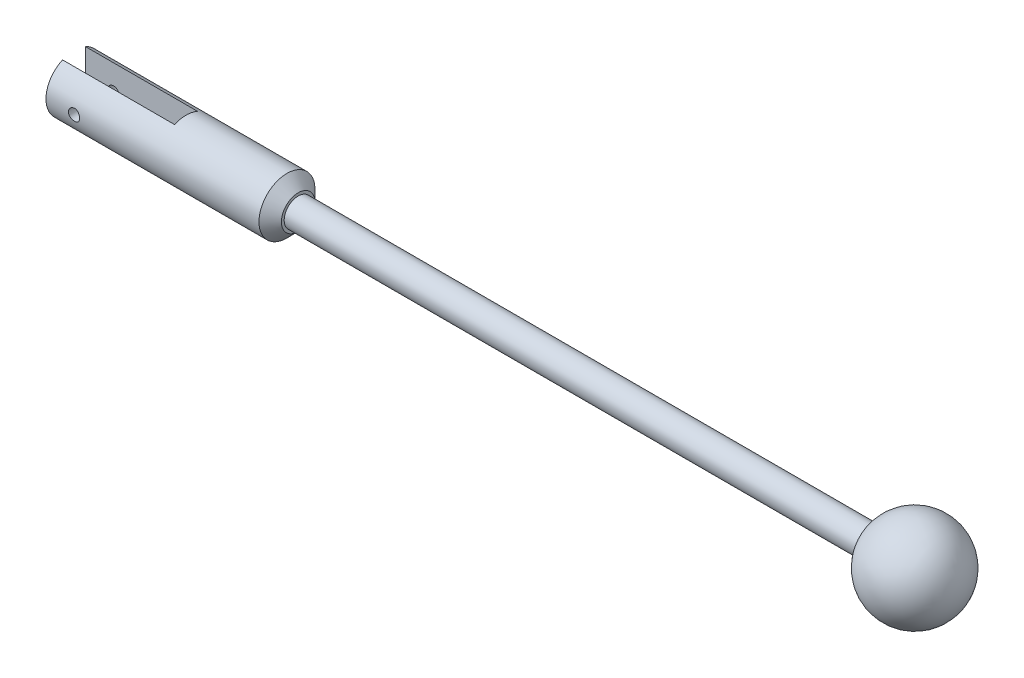
ISO-10303-21;
HEADER;
FILE_DESCRIPTION(('STEP AP214'),'2;1');
FILE_NAME('part.step','',(''),(''),'','','');
FILE_SCHEMA(('AUTOMOTIVE_DESIGN { 1 0 10303 214 1 1 1 1 }'));
ENDSEC;
DATA;
#1=APPLICATION_CONTEXT('core data for automotive mechanical design processes');
#2=APPLICATION_PROTOCOL_DEFINITION('international standard','automotive_design',2000,#1);
#3=PRODUCT_CONTEXT('',#1,'mechanical');
#4=PRODUCT('Part','Part','',(#3));
#5=PRODUCT_RELATED_PRODUCT_CATEGORY('part','',(#4));
#6=PRODUCT_DEFINITION_FORMATION('','',#4);
#7=PRODUCT_DEFINITION_CONTEXT('part definition',#1,'design');
#8=PRODUCT_DEFINITION('design','',#6,#7);
#9=PRODUCT_DEFINITION_SHAPE('','',#8);
#10=(LENGTH_UNIT() NAMED_UNIT(*) SI_UNIT(.MILLI.,.METRE.));
#11=(NAMED_UNIT(*) PLANE_ANGLE_UNIT() SI_UNIT($,.RADIAN.));
#12=(NAMED_UNIT(*) SI_UNIT($,.STERADIAN.) SOLID_ANGLE_UNIT());
#13=UNCERTAINTY_MEASURE_WITH_UNIT(LENGTH_MEASURE(1.E-05),#10,'distance_accuracy_value','');
#14=(GEOMETRIC_REPRESENTATION_CONTEXT(3) GLOBAL_UNCERTAINTY_ASSIGNED_CONTEXT((#13)) GLOBAL_UNIT_ASSIGNED_CONTEXT((#10,
#11,#12)) REPRESENTATION_CONTEXT('',''));
#15=CARTESIAN_POINT('',(0.,0.,0.));
#16=DIRECTION('',(0.,0.,1.));
#17=DIRECTION('',(1.,0.,0.));
#18=AXIS2_PLACEMENT_3D('',#15,#16,#17);
#19=CARTESIAN_POINT('',(-17.5,0.,0.));
#20=DIRECTION('',(-1.,0.,0.));
#21=DIRECTION('',(0.,0.,1.));
#22=AXIS2_PLACEMENT_3D('',#19,#20,#21);
#23=CYLINDRICAL_SURFACE('',#22,2.5);
#24=CARTESIAN_POINT('',(-34.5,0.,-2.5));
#25=CARTESIAN_POINT('',(-34.5000010222492,-0.0277884533963162,-2.49999948790436));
#26=CARTESIAN_POINT('',(-34.5023244214838,-0.0555898301007603,-2.49953192589115));
#27=CARTESIAN_POINT('',(-34.5115492500576,-0.110406753844509,-2.49771182811616));
#28=CARTESIAN_POINT('',(-34.5184543164007,-0.137421658770677,-2.49635858930093));
#29=CARTESIAN_POINT('',(-34.5366206368104,-0.189865152631657,-2.49291824639143));
#30=CARTESIAN_POINT('',(-34.5478777184223,-0.215295233966568,-2.49083184538359));
#31=CARTESIAN_POINT('',(-34.5744161237556,-0.263903994432113,-2.48615199017657));
#32=CARTESIAN_POINT('',(-34.5896972078036,-0.287082807537904,-2.48355856617854));
#33=CARTESIAN_POINT('',(-34.6240692471457,-0.33084673865743,-2.47811082664985));
#34=CARTESIAN_POINT('',(-34.6432041776956,-0.351396975579262,-2.47525372752174));
#35=CARTESIAN_POINT('',(-34.6846462081958,-0.389018378304014,-2.46962090226294));
#36=CARTESIAN_POINT('',(-34.7069535556676,-0.406089272385212,-2.46684518250212));
#37=CARTESIAN_POINT('',(-34.7543580965059,-0.43641587667381,-2.46166220906308));
#38=CARTESIAN_POINT('',(-34.7794788218982,-0.449635469432934,-2.45925853682473));
#39=CARTESIAN_POINT('',(-34.831640909502,-0.471652833290154,-2.45513134029209));
#40=CARTESIAN_POINT('',(-34.8586820816732,-0.480451041218618,-2.45340774880981));
#41=CARTESIAN_POINT('',(-34.913542181954,-0.493262649942413,-2.45086402626102));
#42=CARTESIAN_POINT('',(-34.9413462720711,-0.497337248979388,-2.45003235053594));
#43=CARTESIAN_POINT('',(-34.9972549106822,-0.500776063863058,-2.44933187530314));
#44=CARTESIAN_POINT('',(-35.0253594281601,-0.500140761356749,-2.4494629773392));
#45=CARTESIAN_POINT('',(-35.0806233940105,-0.49422728655091,-2.45066275574092));
#46=CARTESIAN_POINT('',(-35.1077907028136,-0.489019270121953,-2.45171726429382));
#47=CARTESIAN_POINT('',(-35.1608580383315,-0.474218942311526,-2.45462273080001));
#48=CARTESIAN_POINT('',(-35.1867580044595,-0.464626421550342,-2.45647372678889));
#49=CARTESIAN_POINT('',(-35.2367576308518,-0.441262391837361,-2.46077809250204));
#50=CARTESIAN_POINT('',(-35.2608439397846,-0.427463075616057,-2.46323544906852));
#51=CARTESIAN_POINT('',(-35.3063854249864,-0.396096787286339,-2.46847309386531));
#52=CARTESIAN_POINT('',(-35.3278402984256,-0.378529382178414,-2.47125341919183));
#53=CARTESIAN_POINT('',(-35.3679147012285,-0.33974996728029,-2.47688510620731));
#54=CARTESIAN_POINT('',(-35.3864762839296,-0.31847808060622,-2.47973684605452));
#55=CARTESIAN_POINT('',(-35.4197769231506,-0.273092512031003,-2.48514424357204));
#56=CARTESIAN_POINT('',(-35.4345159306468,-0.248978793689694,-2.48769989744487));
#57=CARTESIAN_POINT('',(-35.459763754613,-0.198529693439462,-2.49223345080444));
#58=CARTESIAN_POINT('',(-35.4702659468223,-0.172190909792653,-2.49421044424136));
#59=CARTESIAN_POINT('',(-35.4866802370193,-0.118074488224335,-2.49735704493929));
#60=CARTESIAN_POINT('',(-35.4925928910368,-0.0902970250362264,-2.49852675000266));
#61=CARTESIAN_POINT('',(-35.4995782268971,-0.0345897028135759,-2.49991335933434));
#62=CARTESIAN_POINT('',(-35.5007302097701,-0.00667016416278892,-2.50014587326235));
#63=CARTESIAN_POINT('',(-35.4983750705289,0.0489624670963558,-2.49967525965051));
#64=CARTESIAN_POINT('',(-35.4948682103237,0.0766755712218952,-2.49897218470723));
#65=CARTESIAN_POINT('',(-35.483360813228,0.130852829973268,-2.49671916004009));
#66=CARTESIAN_POINT('',(-35.475400965751,0.157325974169949,-2.49517688202103));
#67=CARTESIAN_POINT('',(-35.4552580086721,0.208561813749831,-2.49141776030516));
#68=CARTESIAN_POINT('',(-35.4430745826616,0.233324380818767,-2.48920086607113));
#69=CARTESIAN_POINT('',(-35.4146587546743,0.280770586843106,-2.48429955766647));
#70=CARTESIAN_POINT('',(-35.3983786094805,0.303425063376092,-2.48160975218526));
#71=CARTESIAN_POINT('',(-35.3622954043963,0.345709009559601,-2.47607367414941));
#72=CARTESIAN_POINT('',(-35.3424919668001,0.365338154465377,-2.47322738484194));
#73=CARTESIAN_POINT('',(-35.2995633240544,0.401320295387084,-2.46764651778483));
#74=CARTESIAN_POINT('',(-35.2763921278893,0.417618851224324,-2.46491430116652));
#75=CARTESIAN_POINT('',(-35.2275943193217,0.446092710025601,-2.45992095898097));
#76=CARTESIAN_POINT('',(-35.2019678052132,0.45826817796145,-2.45765981456671));
#77=CARTESIAN_POINT('',(-35.1491158769252,0.478075920790979,-2.45388370292191));
#78=CARTESIAN_POINT('',(-35.1218995793948,0.485731749895525,-2.45236487436093));
#79=CARTESIAN_POINT('',(-35.0665332732545,0.496354325813598,-2.45023718396013));
#80=CARTESIAN_POINT('',(-35.0383833868953,0.499321684112555,-2.44962820345556));
#81=CARTESIAN_POINT('',(-34.9824955677278,0.500460455433733,-2.4493957481569));
#82=CARTESIAN_POINT('',(-34.9547594255365,0.498717894035447,-2.4497545959465));
#83=CARTESIAN_POINT('',(-34.8999841750475,0.49067615205003,-2.45137786742307));
#84=CARTESIAN_POINT('',(-34.8729450611526,0.484377008064648,-2.45264228383585));
#85=CARTESIAN_POINT('',(-34.8203861443797,0.467439284249475,-2.45592632109579));
#86=CARTESIAN_POINT('',(-34.7948628197488,0.45681125335867,-2.45794410509415));
#87=CARTESIAN_POINT('',(-34.7459481396328,0.4315273223008,-2.46250857487085));
#88=CARTESIAN_POINT('',(-34.7225569631374,0.416871084387441,-2.46505530499447));
#89=CARTESIAN_POINT('',(-34.6781422139248,0.383652957393207,-2.47044480261613));
#90=CARTESIAN_POINT('',(-34.6571656173662,0.365028943617589,-2.4732918645485));
#91=CARTESIAN_POINT('',(-34.6186068972354,0.324532184506568,-2.47893040935977));
#92=CARTESIAN_POINT('',(-34.6010255548414,0.302658693576666,-2.48172187931592));
#93=CARTESIAN_POINT('',(-34.5695826780268,0.256008814544122,-2.48696916193986));
#94=CARTESIAN_POINT('',(-34.55576199836,0.231204442214915,-2.48942115609623));
#95=CARTESIAN_POINT('',(-34.5325069387017,0.179583180470364,-2.493675625425));
#96=CARTESIAN_POINT('',(-34.5230686052337,0.152768130431562,-2.49547868569308));
#97=CARTESIAN_POINT('',(-34.5106740259776,0.10491074446189,-2.49788186297685));
#98=CARTESIAN_POINT('',(-34.5066784031461,0.0841408320068929,-2.49867151579226));
#99=CARTESIAN_POINT('',(-34.5013410438208,0.0422497626050339,-2.49973077069946));
#100=CARTESIAN_POINT('',(-34.4999992227451,0.0211286168743097,-2.50000038936577));
#101=CARTESIAN_POINT('',(-34.5,0.,-2.5));
#102=B_SPLINE_CURVE_WITH_KNOTS('',3,(#24,#25,#26,#27,#28,#29,#30,#31,#32,#33,#34,#35,#36,#37,
#38,#39,#40,#41,#42,#43,#44,#45,#46,#47,#48,#49,#50,#51,#52,#53,#54,#55,#56,#57,#58,#59,#60,#61,
#62,#63,#64,#65,#66,#67,#68,#69,#70,#71,#72,#73,#74,#75,#76,#77,#78,#79,#80,#81,#82,#83,#84,#85,
#86,#87,#88,#89,#90,#91,#92,#93,#94,#95,#96,#97,#98,#99,#100,#101),.UNSPECIFIED.,.T.,.F.,(4,2,2,
2,2,2,2,2,2,2,2,2,2,2,2,2,2,2,2,2,2,2,2,2,2,2,2,2,2,2,2,2,2,2,2,2,2,2,4),(0.,0.0832880653306286,
0.16664232534566,0.24991686762517,0.333186451115431,0.417466335056094,0.501752798373683,
0.586805975029615,0.671850746825986,0.755780925517941,0.839702521406118,0.922358635031387,
1.00501869626864,1.08823745101796,1.17146577374835,1.25619126245675,1.3409178376991,
1.42577637427011,1.51062462849017,1.59405367838132,1.67747803828933,1.76015226975361,
1.84283269608011,1.92652533016678,2.01022694172964,2.09520314289612,2.18017594361733,
2.26470190516361,2.34921684165207,2.4321986128385,2.51517971746304,2.59795980626555,
2.68074683790933,2.76494038119571,2.84915327266465,2.93424748337818,3.01926477758759,
3.08259387644946,3.14592095685497),.UNSPECIFIED.);
#103=CARTESIAN_POINT('',(-34.5,0.,-2.5));
#104=VERTEX_POINT('',#103);
#105=EDGE_CURVE('E158',#104,#104,#102,.T.);
#106=ORIENTED_EDGE('',*,*,#105,.F.);
#107=EDGE_LOOP('',(#106));
#108=FACE_BOUND('',#107,.T.);
#109=CARTESIAN_POINT('',(-34.5,0.,2.5));
#110=CARTESIAN_POINT('',(-34.5000010222492,0.0277884533963162,2.49999948790436));
#111=CARTESIAN_POINT('',(-34.5023244214838,0.0555898301007603,2.49953192589115));
#112=CARTESIAN_POINT('',(-34.5115492500576,0.110406753844509,2.49771182811616));
#113=CARTESIAN_POINT('',(-34.5184543164007,0.137421658770677,2.49635858930093));
#114=CARTESIAN_POINT('',(-34.5366206368104,0.189865152631657,2.49291824639143));
#115=CARTESIAN_POINT('',(-34.5478777184223,0.215295233966568,2.49083184538359));
#116=CARTESIAN_POINT('',(-34.5744161237556,0.263903994432113,2.48615199017657));
#117=CARTESIAN_POINT('',(-34.5896972078036,0.287082807537904,2.48355856617854));
#118=CARTESIAN_POINT('',(-34.6240692471457,0.33084673865743,2.47811082664985));
#119=CARTESIAN_POINT('',(-34.6432041776956,0.351396975579262,2.47525372752174));
#120=CARTESIAN_POINT('',(-34.6846462081958,0.389018378304014,2.46962090226294));
#121=CARTESIAN_POINT('',(-34.7069535556676,0.406089272385212,2.46684518250212));
#122=CARTESIAN_POINT('',(-34.7543580965059,0.43641587667381,2.46166220906308));
#123=CARTESIAN_POINT('',(-34.7794788218982,0.449635469432934,2.45925853682473));
#124=CARTESIAN_POINT('',(-34.831640909502,0.471652833290154,2.45513134029209));
#125=CARTESIAN_POINT('',(-34.8586820816732,0.480451041218618,2.45340774880981));
#126=CARTESIAN_POINT('',(-34.913542181954,0.493262649942413,2.45086402626102));
#127=CARTESIAN_POINT('',(-34.9413462720711,0.497337248979388,2.45003235053594));
#128=CARTESIAN_POINT('',(-34.9972549106822,0.500776063863058,2.44933187530314));
#129=CARTESIAN_POINT('',(-35.0253594281601,0.500140761356749,2.4494629773392));
#130=CARTESIAN_POINT('',(-35.0806233940105,0.49422728655091,2.45066275574092));
#131=CARTESIAN_POINT('',(-35.1077907028136,0.489019270121953,2.45171726429382));
#132=CARTESIAN_POINT('',(-35.1608580383315,0.474218942311526,2.45462273080001));
#133=CARTESIAN_POINT('',(-35.1867580044595,0.464626421550342,2.45647372678889));
#134=CARTESIAN_POINT('',(-35.2367576308518,0.441262391837361,2.46077809250204));
#135=CARTESIAN_POINT('',(-35.2608439397846,0.427463075616057,2.46323544906852));
#136=CARTESIAN_POINT('',(-35.3063854249864,0.396096787286339,2.46847309386531));
#137=CARTESIAN_POINT('',(-35.3278402984256,0.378529382178414,2.47125341919183));
#138=CARTESIAN_POINT('',(-35.3679147012285,0.33974996728029,2.47688510620731));
#139=CARTESIAN_POINT('',(-35.3864762839296,0.31847808060622,2.47973684605452));
#140=CARTESIAN_POINT('',(-35.4197769231506,0.273092512031003,2.48514424357204));
#141=CARTESIAN_POINT('',(-35.4345159306468,0.248978793689694,2.48769989744487));
#142=CARTESIAN_POINT('',(-35.459763754613,0.198529693439462,2.49223345080444));
#143=CARTESIAN_POINT('',(-35.4702659468223,0.172190909792653,2.49421044424136));
#144=CARTESIAN_POINT('',(-35.4866802370193,0.118074488224335,2.49735704493929));
#145=CARTESIAN_POINT('',(-35.4925928910368,0.0902970250362264,2.49852675000266));
#146=CARTESIAN_POINT('',(-35.4995782268971,0.0345897028135759,2.49991335933434));
#147=CARTESIAN_POINT('',(-35.5007302097701,0.00667016416278892,2.50014587326235));
#148=CARTESIAN_POINT('',(-35.4983750705289,-0.0489624670963558,2.49967525965051));
#149=CARTESIAN_POINT('',(-35.4948682103237,-0.0766755712218952,2.49897218470723));
#150=CARTESIAN_POINT('',(-35.483360813228,-0.130852829973268,2.49671916004009));
#151=CARTESIAN_POINT('',(-35.475400965751,-0.157325974169949,2.49517688202103));
#152=CARTESIAN_POINT('',(-35.4552580086721,-0.208561813749831,2.49141776030516));
#153=CARTESIAN_POINT('',(-35.4430745826616,-0.233324380818767,2.48920086607113));
#154=CARTESIAN_POINT('',(-35.4146587546743,-0.280770586843106,2.48429955766647));
#155=CARTESIAN_POINT('',(-35.3983786094805,-0.303425063376092,2.48160975218526));
#156=CARTESIAN_POINT('',(-35.3622954043963,-0.345709009559601,2.47607367414941));
#157=CARTESIAN_POINT('',(-35.3424919668001,-0.365338154465377,2.47322738484194));
#158=CARTESIAN_POINT('',(-35.2995633240544,-0.401320295387084,2.46764651778483));
#159=CARTESIAN_POINT('',(-35.2763921278893,-0.417618851224324,2.46491430116652));
#160=CARTESIAN_POINT('',(-35.2275943193217,-0.446092710025601,2.45992095898097));
#161=CARTESIAN_POINT('',(-35.2019678052132,-0.45826817796145,2.45765981456671));
#162=CARTESIAN_POINT('',(-35.1491158769252,-0.478075920790979,2.45388370292191));
#163=CARTESIAN_POINT('',(-35.1218995793948,-0.485731749895525,2.45236487436093));
#164=CARTESIAN_POINT('',(-35.0665332732545,-0.496354325813598,2.45023718396013));
#165=CARTESIAN_POINT('',(-35.0383833868953,-0.499321684112555,2.44962820345556));
#166=CARTESIAN_POINT('',(-34.9824955677278,-0.500460455433733,2.4493957481569));
#167=CARTESIAN_POINT('',(-34.9547594255365,-0.498717894035447,2.4497545959465));
#168=CARTESIAN_POINT('',(-34.8999841750475,-0.49067615205003,2.45137786742307));
#169=CARTESIAN_POINT('',(-34.8729450611526,-0.484377008064648,2.45264228383585));
#170=CARTESIAN_POINT('',(-34.8203861443797,-0.467439284249475,2.45592632109579));
#171=CARTESIAN_POINT('',(-34.7948628197488,-0.45681125335867,2.45794410509415));
#172=CARTESIAN_POINT('',(-34.7459481396328,-0.4315273223008,2.46250857487085));
#173=CARTESIAN_POINT('',(-34.7225569631374,-0.416871084387441,2.46505530499447));
#174=CARTESIAN_POINT('',(-34.6781422139248,-0.383652957393207,2.47044480261613));
#175=CARTESIAN_POINT('',(-34.6571656173662,-0.365028943617589,2.4732918645485));
#176=CARTESIAN_POINT('',(-34.6186068972354,-0.324532184506568,2.47893040935977));
#177=CARTESIAN_POINT('',(-34.6010255548414,-0.302658693576666,2.48172187931592));
#178=CARTESIAN_POINT('',(-34.5695826780268,-0.256008814544122,2.48696916193986));
#179=CARTESIAN_POINT('',(-34.55576199836,-0.231204442214915,2.48942115609623));
#180=CARTESIAN_POINT('',(-34.5325069387017,-0.179583180470364,2.493675625425));
#181=CARTESIAN_POINT('',(-34.5230686052337,-0.152768130431562,2.49547868569308));
#182=CARTESIAN_POINT('',(-34.5106740259776,-0.10491074446189,2.49788186297685));
#183=CARTESIAN_POINT('',(-34.5066784031461,-0.0841408320068929,2.49867151579226));
#184=CARTESIAN_POINT('',(-34.5013410438208,-0.0422497626050339,2.49973077069946));
#185=CARTESIAN_POINT('',(-34.4999992227451,-0.0211286168743097,2.50000038936577));
#186=CARTESIAN_POINT('',(-34.5,0.,2.5));
#187=B_SPLINE_CURVE_WITH_KNOTS('',3,(#109,#110,#111,#112,#113,#114,#115,#116,#117,#118,#119,
#120,#121,#122,#123,#124,#125,#126,#127,#128,#129,#130,#131,#132,#133,#134,#135,#136,#137,#138,
#139,#140,#141,#142,#143,#144,#145,#146,#147,#148,#149,#150,#151,#152,#153,#154,#155,#156,#157,
#158,#159,#160,#161,#162,#163,#164,#165,#166,#167,#168,#169,#170,#171,#172,#173,#174,#175,#176,
#177,#178,#179,#180,#181,#182,#183,#184,#185,#186),.UNSPECIFIED.,.T.,.F.,(4,2,2,2,2,2,2,2,2,2,2,
2,2,2,2,2,2,2,2,2,2,2,2,2,2,2,2,2,2,2,2,2,2,2,2,2,2,2,4),(0.,0.0832880653306286,
0.16664232534566,0.24991686762517,0.333186451115431,0.417466335056094,0.501752798373683,
0.586805975029615,0.671850746825986,0.755780925517941,0.839702521406118,0.922358635031387,
1.00501869626864,1.08823745101796,1.17146577374835,1.25619126245675,1.3409178376991,
1.42577637427011,1.51062462849017,1.59405367838132,1.67747803828933,1.76015226975361,
1.84283269608011,1.92652533016678,2.01022694172964,2.09520314289612,2.18017594361733,
2.26470190516361,2.34921684165207,2.4321986128385,2.51517971746304,2.59795980626555,
2.68074683790933,2.76494038119571,2.84915327266465,2.93424748337818,3.01926477758759,
3.08259387644946,3.14592095685497),.UNSPECIFIED.);
#188=CARTESIAN_POINT('',(-34.5,0.,2.5));
#189=VERTEX_POINT('',#188);
#190=EDGE_CURVE('E152',#189,#189,#187,.T.);
#191=ORIENTED_EDGE('',*,*,#190,.F.);
#192=EDGE_LOOP('',(#191));
#193=FACE_BOUND('',#192,.T.);
#194=CARTESIAN_POINT('',(-18.5,0.,0.));
#195=DIRECTION('',(-1.,0.,0.));
#196=DIRECTION('',(0.,0.,1.));
#197=AXIS2_PLACEMENT_3D('',#194,#195,#196);
#198=CIRCLE('',#197,2.5);
#199=CARTESIAN_POINT('',(-18.5,0.,2.5));
#200=VERTEX_POINT('',#199);
#201=EDGE_CURVE('E138',#200,#200,#198,.T.);
#202=ORIENTED_EDGE('',*,*,#201,.T.);
#203=EDGE_LOOP('',(#202));
#204=FACE_BOUND('',#203,.T.);
#205=CARTESIAN_POINT('',(-37.5,0.,0.));
#206=DIRECTION('',(-1.,0.,0.));
#207=DIRECTION('',(0.,0.,1.));
#208=AXIS2_PLACEMENT_3D('',#205,#206,#207);
#209=CIRCLE('',#208,2.5);
#210=CARTESIAN_POINT('',(-37.5,-2.28021380576471,1.025));
#211=VERTEX_POINT('',#210);
#212=CARTESIAN_POINT('',(-37.5,2.28021380576471,1.025));
#213=VERTEX_POINT('',#212);
#214=EDGE_CURVE('E125',#211,#213,#209,.T.);
#215=ORIENTED_EDGE('',*,*,#214,.F.);
#216=DIRECTION('',(-1.,0.,0.));
#217=VECTOR('',#216,1.);
#218=CARTESIAN_POINT('',(-17.5,-2.28021380576471,1.025));
#219=LINE('',#218,#217);
#220=CARTESIAN_POINT('',(-27.5,-2.28021380576471,1.025));
#221=VERTEX_POINT('',#220);
#222=EDGE_CURVE('E118',#211,#221,#219,.F.);
#223=ORIENTED_EDGE('',*,*,#222,.T.);
#224=CARTESIAN_POINT('',(-27.5,0.,0.));
#225=DIRECTION('',(1.,0.,0.));
#226=DIRECTION('',(0.,0.,-1.));
#227=AXIS2_PLACEMENT_3D('',#224,#225,#226);
#228=CIRCLE('',#227,2.5);
#229=CARTESIAN_POINT('',(-27.5,-2.28021380576471,-1.025));
#230=VERTEX_POINT('',#229);
#231=EDGE_CURVE('E101',#230,#221,#228,.F.);
#232=ORIENTED_EDGE('',*,*,#231,.F.);
#233=DIRECTION('',(-1.,0.,0.));
#234=VECTOR('',#233,1.);
#235=CARTESIAN_POINT('',(-17.5,-2.28021380576471,-1.025));
#236=LINE('',#235,#234);
#237=CARTESIAN_POINT('',(-37.5,-2.28021380576471,-1.025));
#238=VERTEX_POINT('',#237);
#239=EDGE_CURVE('E106',#230,#238,#236,.T.);
#240=ORIENTED_EDGE('',*,*,#239,.T.);
#241=CARTESIAN_POINT('',(-37.5,2.28021380576471,-1.025));
#242=VERTEX_POINT('',#241);
#243=EDGE_CURVE('E112',#242,#238,#209,.T.);
#244=ORIENTED_EDGE('',*,*,#243,.F.);
#245=DIRECTION('',(-1.,0.,0.));
#246=VECTOR('',#245,1.);
#247=CARTESIAN_POINT('',(-17.5,2.28021380576471,-1.025));
#248=LINE('',#247,#246);
#249=CARTESIAN_POINT('',(-27.5,2.28021380576471,-1.025));
#250=VERTEX_POINT('',#249);
#251=EDGE_CURVE('E66',#242,#250,#248,.F.);
#252=ORIENTED_EDGE('',*,*,#251,.T.);
#253=CARTESIAN_POINT('',(-27.5,2.28021380576471,1.025));
#254=VERTEX_POINT('',#253);
#255=EDGE_CURVE('E94',#254,#250,#228,.F.);
#256=ORIENTED_EDGE('',*,*,#255,.F.);
#257=DIRECTION('',(-1.,0.,0.));
#258=VECTOR('',#257,1.);
#259=CARTESIAN_POINT('',(-17.5,2.28021380576471,1.025));
#260=LINE('',#259,#258);
#261=EDGE_CURVE('E114',#254,#213,#260,.T.);
#262=ORIENTED_EDGE('',*,*,#261,.T.);
#263=EDGE_LOOP('',(#215,#223,#232,#240,#244,#252,#256,#262));
#264=FACE_BOUND('',#263,.T.);
#265=ADVANCED_FACE('F49',(#108,#193,#204,#264),#23,.T.);
#266=CARTESIAN_POINT('',(-37.5,0.,0.));
#267=DIRECTION('',(1.,0.,0.));
#268=DIRECTION('',(0.,0.,-1.));
#269=AXIS2_PLACEMENT_3D('',#266,#267,#268);
#270=PLANE('',#269);
#271=DIRECTION('',(0.,1.,0.));
#272=VECTOR('',#271,1.);
#273=CARTESIAN_POINT('',(-37.5,0.,1.025));
#274=LINE('',#273,#272);
#275=EDGE_CURVE('E74',#211,#213,#274,.T.);
#276=ORIENTED_EDGE('',*,*,#275,.F.);
#277=ORIENTED_EDGE('',*,*,#214,.T.);
#278=EDGE_LOOP('',(#276,#277));
#279=FACE_BOUND('',#278,.T.);
#280=ADVANCED_FACE('F202',(#279),#270,.F.);
#281=DIRECTION('',(0.,-1.,0.));
#282=VECTOR('',#281,1.);
#283=CARTESIAN_POINT('',(-37.5,0.,-1.025));
#284=LINE('',#283,#282);
#285=EDGE_CURVE('E133',#242,#238,#284,.T.);
#286=ORIENTED_EDGE('',*,*,#285,.F.);
#287=ORIENTED_EDGE('',*,*,#243,.T.);
#288=EDGE_LOOP('',(#286,#287));
#289=FACE_BOUND('',#288,.T.);
#290=ADVANCED_FACE('F198',(#289),#270,.F.);
#291=CARTESIAN_POINT('',(-37.5,0.,0.));
#292=DIRECTION('',(-1.,0.,0.));
#293=DIRECTION('',(0.,0.,1.));
#294=AXIS2_PLACEMENT_3D('',#291,#292,#293);
#295=CYLINDRICAL_SURFACE('',#294,1.25);
#296=CARTESIAN_POINT('',(33.7003289616073,0.,0.));
#297=DIRECTION('',(1.,0.,0.));
#298=DIRECTION('',(0.,0.,-1.));
#299=AXIS2_PLACEMENT_3D('',#296,#297,#298);
#300=CIRCLE('',#299,1.25);
#301=CARTESIAN_POINT('',(33.7003289616073,0.,-1.25));
#302=VERTEX_POINT('',#301);
#303=EDGE_CURVE('E11',#302,#302,#300,.T.);
#304=ORIENTED_EDGE('',*,*,#303,.F.);
#305=EDGE_LOOP('',(#304));
#306=FACE_BOUND('',#305,.T.);
#307=CARTESIAN_POINT('',(-17.5,0.,0.));
#308=DIRECTION('',(-1.,0.,0.));
#309=DIRECTION('',(0.,0.,1.));
#310=AXIS2_PLACEMENT_3D('',#307,#308,#309);
#311=CIRCLE('',#310,1.25);
#312=CARTESIAN_POINT('',(-17.5,0.,1.25));
#313=VERTEX_POINT('',#312);
#314=EDGE_CURVE('E129',#313,#313,#311,.F.);
#315=ORIENTED_EDGE('',*,*,#314,.T.);
#316=EDGE_LOOP('',(#315));
#317=FACE_BOUND('',#316,.T.);
#318=ADVANCED_FACE('F192',(#306,#317),#295,.T.);
#319=CARTESIAN_POINT('',(-17.5,0.,0.));
#320=DIRECTION('',(-1.,0.,0.));
#321=DIRECTION('',(0.,0.,1.));
#322=AXIS2_PLACEMENT_3D('',#319,#320,#321);
#323=PLANE('',#322);
#324=CARTESIAN_POINT('',(-17.5,0.,0.));
#325=DIRECTION('',(-1.,0.,0.));
#326=DIRECTION('',(0.,0.,1.));
#327=AXIS2_PLACEMENT_3D('',#324,#325,#326);
#328=CIRCLE('',#327,1.50000000000001);
#329=CARTESIAN_POINT('',(-17.5,0.,1.50000000000001));
#330=VERTEX_POINT('',#329);
#331=EDGE_CURVE('E59',#330,#330,#328,.F.);
#332=ORIENTED_EDGE('',*,*,#331,.T.);
#333=EDGE_LOOP('',(#332));
#334=FACE_BOUND('',#333,.T.);
#335=ORIENTED_EDGE('',*,*,#314,.F.);
#336=EDGE_LOOP('',(#335));
#337=FACE_BOUND('',#336,.T.);
#338=ADVANCED_FACE('F189',(#334,#337),#323,.F.);
#339=CARTESIAN_POINT('',(-37.500012,-2.5,1.025));
#340=DIRECTION('',(0.,0.,-1.));
#341=DIRECTION('',(-1.,0.,0.));
#342=AXIS2_PLACEMENT_3D('',#339,#340,#341);
#343=PLANE('',#342);
#344=CARTESIAN_POINT('',(-35.,0.,1.025));
#345=DIRECTION('',(0.,0.,-1.));
#346=DIRECTION('',(-1.,0.,0.));
#347=AXIS2_PLACEMENT_3D('',#344,#345,#346);
#348=CIRCLE('',#347,0.499999999999999);
#349=CARTESIAN_POINT('',(-35.5,0.,1.025));
#350=VERTEX_POINT('',#349);
#351=EDGE_CURVE('E147',#350,#350,#348,.T.);
#352=ORIENTED_EDGE('',*,*,#351,.F.);
#353=EDGE_LOOP('',(#352));
#354=FACE_BOUND('',#353,.T.);
#355=ORIENTED_EDGE('',*,*,#275,.T.);
#356=ORIENTED_EDGE('',*,*,#261,.F.);
#357=DIRECTION('',(0.,1.,0.));
#358=VECTOR('',#357,1.);
#359=CARTESIAN_POINT('',(-27.5,-2.5,1.025));
#360=LINE('',#359,#358);
#361=EDGE_CURVE('E98',#221,#254,#360,.T.);
#362=ORIENTED_EDGE('',*,*,#361,.F.);
#363=ORIENTED_EDGE('',*,*,#222,.F.);
#364=EDGE_LOOP('',(#355,#356,#362,#363));
#365=FACE_BOUND('',#364,.T.);
#366=ADVANCED_FACE('F186',(#354,#365),#343,.T.);
#367=CARTESIAN_POINT('',(-37.500012,-2.5,-1.025));
#368=DIRECTION('',(0.,0.,1.));
#369=DIRECTION('',(1.,0.,0.));
#370=AXIS2_PLACEMENT_3D('',#367,#368,#369);
#371=PLANE('',#370);
#372=CARTESIAN_POINT('',(-35.,0.,-1.025));
#373=DIRECTION('',(0.,0.,1.));
#374=DIRECTION('',(1.,0.,0.));
#375=AXIS2_PLACEMENT_3D('',#372,#373,#374);
#376=CIRCLE('',#375,0.499999999999999);
#377=CARTESIAN_POINT('',(-34.5,0.,-1.025));
#378=VERTEX_POINT('',#377);
#379=EDGE_CURVE('E144',#378,#378,#376,.T.);
#380=ORIENTED_EDGE('',*,*,#379,.F.);
#381=EDGE_LOOP('',(#380));
#382=FACE_BOUND('',#381,.T.);
#383=ORIENTED_EDGE('',*,*,#285,.T.);
#384=ORIENTED_EDGE('',*,*,#239,.F.);
#385=DIRECTION('',(0.,-1.,0.));
#386=VECTOR('',#385,1.);
#387=CARTESIAN_POINT('',(-27.5,-2.5,-1.025));
#388=LINE('',#387,#386);
#389=EDGE_CURVE('E96',#250,#230,#388,.T.);
#390=ORIENTED_EDGE('',*,*,#389,.F.);
#391=ORIENTED_EDGE('',*,*,#251,.F.);
#392=EDGE_LOOP('',(#383,#384,#390,#391));
#393=FACE_BOUND('',#392,.T.);
#394=ADVANCED_FACE('F104',(#382,#393),#371,.T.);
#395=CARTESIAN_POINT('',(-27.5,0.,0.));
#396=DIRECTION('',(1.,0.,0.));
#397=DIRECTION('',(0.,0.,-1.));
#398=AXIS2_PLACEMENT_3D('',#395,#396,#397);
#399=PLANE('',#398);
#400=ORIENTED_EDGE('',*,*,#389,.T.);
#401=ORIENTED_EDGE('',*,*,#231,.T.);
#402=ORIENTED_EDGE('',*,*,#361,.T.);
#403=ORIENTED_EDGE('',*,*,#255,.T.);
#404=EDGE_LOOP('',(#400,#401,#402,#403));
#405=FACE_BOUND('',#404,.T.);
#406=ADVANCED_FACE('F95',(#405),#399,.F.);
#407=CARTESIAN_POINT('',(-18.5,0.,0.));
#408=DIRECTION('',(-1.,0.,0.));
#409=DIRECTION('',(0.,0.,1.));
#410=AXIS2_PLACEMENT_3D('',#407,#408,#409);
#411=CONICAL_SURFACE('',#410,2.5,0.785398163397452);
#412=ORIENTED_EDGE('',*,*,#331,.F.);
#413=EDGE_LOOP('',(#412));
#414=FACE_BOUND('',#413,.T.);
#415=ORIENTED_EDGE('',*,*,#201,.F.);
#416=EDGE_LOOP('',(#415));
#417=FACE_BOUND('',#416,.T.);
#418=ADVANCED_FACE('F52',(#414,#417),#411,.T.);
#419=CARTESIAN_POINT('',(-35.,0.,-2.5));
#420=DIRECTION('',(0.,0.,1.));
#421=DIRECTION('',(1.,0.,0.));
#422=AXIS2_PLACEMENT_3D('',#419,#420,#421);
#423=CYLINDRICAL_SURFACE('',#422,0.499999999999999);
#424=ORIENTED_EDGE('',*,*,#105,.T.);
#425=EDGE_LOOP('',(#424));
#426=FACE_BOUND('',#425,.T.);
#427=ORIENTED_EDGE('',*,*,#379,.T.);
#428=EDGE_LOOP('',(#427));
#429=FACE_BOUND('',#428,.T.);
#430=ADVANCED_FACE('F173',(#426,#429),#423,.F.);
#431=ORIENTED_EDGE('',*,*,#190,.T.);
#432=EDGE_LOOP('',(#431));
#433=FACE_BOUND('',#432,.T.);
#434=ORIENTED_EDGE('',*,*,#351,.T.);
#435=EDGE_LOOP('',(#434));
#436=FACE_BOUND('',#435,.T.);
#437=ADVANCED_FACE('F178',(#433,#436),#423,.F.);
#438=CARTESIAN_POINT('',(37.5,0.,0.));
#439=DIRECTION('',(0.,0.,1.));
#440=DIRECTION('',(0.,1.,0.));
#441=AXIS2_PLACEMENT_3D('',#438,#439,#440);
#442=SPHERICAL_SURFACE('',#441,4.);
#443=CARTESIAN_POINT('',(37.5,0.,0.));
#444=DIRECTION('',(1.,0.,0.));
#445=DIRECTION('',(0.,0.,-1.));
#446=AXIS2_PLACEMENT_3D('',#443,#444,#445);
#447=SPHERICAL_SURFACE('',#446,4.);
#448=ORIENTED_EDGE('',*,*,#303,.T.);
#449=EDGE_LOOP('',(#448));
#450=FACE_BOUND('',#449,.T.);
#451=ADVANCED_FACE('F180',(#450),#447,.T.);
#452=CLOSED_SHELL('',(#265,#280,#290,#318,#338,#366,#394,#406,#418,#430,#437,#451));
#453=MANIFOLD_SOLID_BREP('B2',#452);
#454=ADVANCED_BREP_SHAPE_REPRESENTATION('',(#18,#453),#14);
#455=SHAPE_DEFINITION_REPRESENTATION(#9,#454);
ENDSEC;
END-ISO-10303-21;
